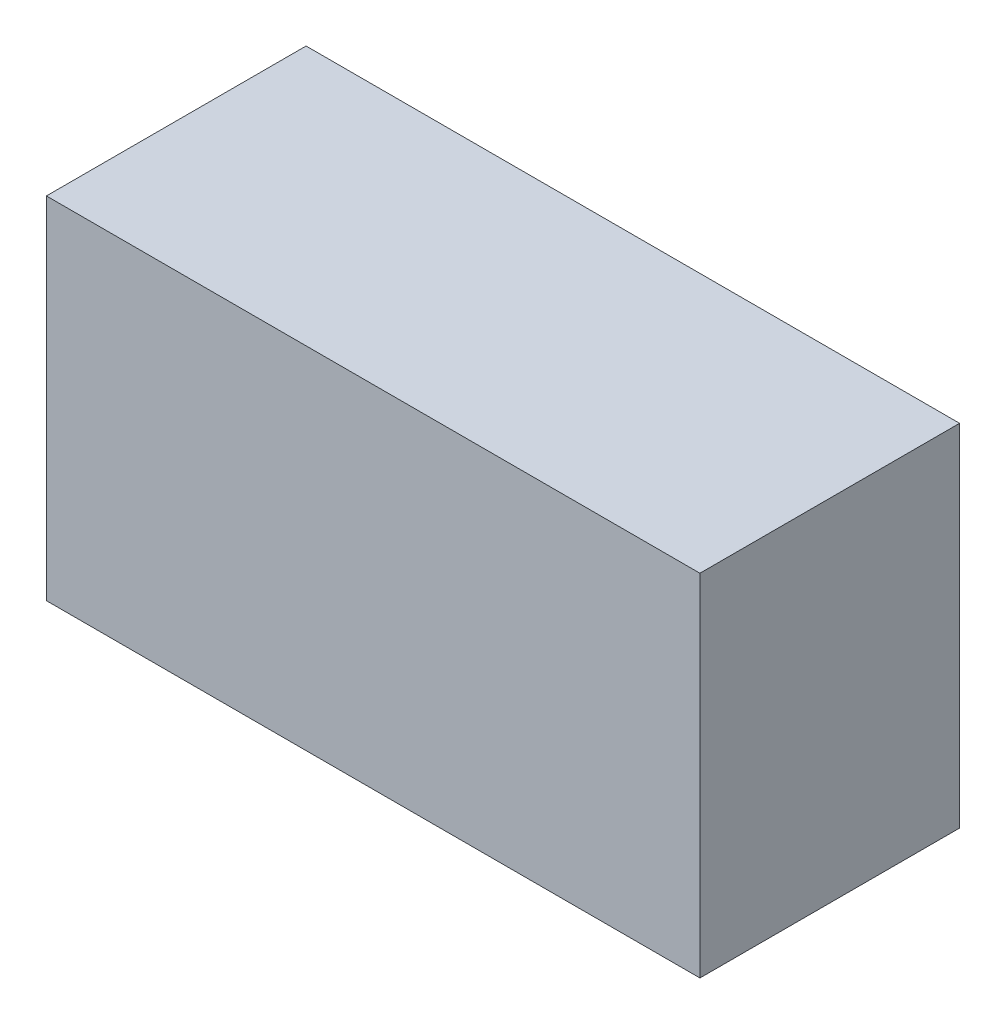
ISO-10303-21;
HEADER;
FILE_DESCRIPTION(('STEP AP214'),'2;1');
FILE_NAME('part.step','',(''),(''),'','','');
FILE_SCHEMA(('AUTOMOTIVE_DESIGN { 1 0 10303 214 1 1 1 1 }'));
ENDSEC;
DATA;
#1=APPLICATION_CONTEXT('core data for automotive mechanical design processes');
#2=APPLICATION_PROTOCOL_DEFINITION('international standard','automotive_design',2000,#1);
#3=PRODUCT_CONTEXT('',#1,'mechanical');
#4=PRODUCT('Part','Part','',(#3));
#5=PRODUCT_RELATED_PRODUCT_CATEGORY('part','',(#4));
#6=PRODUCT_DEFINITION_FORMATION('','',#4);
#7=PRODUCT_DEFINITION_CONTEXT('part definition',#1,'design');
#8=PRODUCT_DEFINITION('design','',#6,#7);
#9=PRODUCT_DEFINITION_SHAPE('','',#8);
#10=(LENGTH_UNIT() NAMED_UNIT(*) SI_UNIT(.MILLI.,.METRE.));
#11=(NAMED_UNIT(*) PLANE_ANGLE_UNIT() SI_UNIT($,.RADIAN.));
#12=(NAMED_UNIT(*) SI_UNIT($,.STERADIAN.) SOLID_ANGLE_UNIT());
#13=UNCERTAINTY_MEASURE_WITH_UNIT(LENGTH_MEASURE(1.E-05),#10,'distance_accuracy_value','');
#14=(GEOMETRIC_REPRESENTATION_CONTEXT(3) GLOBAL_UNCERTAINTY_ASSIGNED_CONTEXT((#13)) GLOBAL_UNIT_ASSIGNED_CONTEXT((#10,
#11,#12)) REPRESENTATION_CONTEXT('',''));
#15=CARTESIAN_POINT('',(0.,0.,0.));
#16=DIRECTION('',(0.,0.,1.));
#17=DIRECTION('',(1.,0.,0.));
#18=AXIS2_PLACEMENT_3D('',#15,#16,#17);
#19=CARTESIAN_POINT('',(-0.75499976,-0.40499792,0.5999988));
#20=DIRECTION('',(0.,0.,1.));
#21=DIRECTION('',(1.,0.,0.));
#22=AXIS2_PLACEMENT_3D('',#19,#20,#21);
#23=PLANE('',#22);
#24=DIRECTION('',(-1.,0.,0.));
#25=VECTOR('',#24,1.);
#26=CARTESIAN_POINT('',(0.75499976,-0.40499792,0.5999988));
#27=LINE('',#26,#25);
#28=CARTESIAN_POINT('',(0.75499976,-0.40499792,0.5999988));
#29=VERTEX_POINT('',#28);
#30=CARTESIAN_POINT('',(-0.75499976,-0.40499792,0.5999988));
#31=VERTEX_POINT('',#30);
#32=EDGE_CURVE('E27',#29,#31,#27,.T.);
#33=ORIENTED_EDGE('',*,*,#32,.F.);
#34=DIRECTION('',(0.,-1.,0.));
#35=VECTOR('',#34,1.);
#36=CARTESIAN_POINT('',(0.75499976,0.40499792,0.5999988));
#37=LINE('',#36,#35);
#38=CARTESIAN_POINT('',(0.75499976,0.40499792,0.5999988));
#39=VERTEX_POINT('',#38);
#40=EDGE_CURVE('E102',#39,#29,#37,.T.);
#41=ORIENTED_EDGE('',*,*,#40,.F.);
#42=DIRECTION('',(1.,0.,0.));
#43=VECTOR('',#42,1.);
#44=CARTESIAN_POINT('',(-0.75499976,0.40499792,0.5999988));
#45=LINE('',#44,#43);
#46=CARTESIAN_POINT('',(-0.75499976,0.40499792,0.5999988));
#47=VERTEX_POINT('',#46);
#48=EDGE_CURVE('E84',#47,#39,#45,.T.);
#49=ORIENTED_EDGE('',*,*,#48,.F.);
#50=DIRECTION('',(0.,1.,0.));
#51=VECTOR('',#50,1.);
#52=CARTESIAN_POINT('',(-0.75499976,-0.40499792,0.5999988));
#53=LINE('',#52,#51);
#54=EDGE_CURVE('E88',#31,#47,#53,.T.);
#55=ORIENTED_EDGE('',*,*,#54,.F.);
#56=EDGE_LOOP('',(#33,#41,#49,#55));
#57=FACE_BOUND('',#56,.T.);
#58=ADVANCED_FACE('F17',(#57),#23,.T.);
#59=CARTESIAN_POINT('',(-0.75499976,-0.40499792,0.));
#60=DIRECTION('',(0.,0.,1.));
#61=DIRECTION('',(1.,0.,0.));
#62=AXIS2_PLACEMENT_3D('',#59,#60,#61);
#63=PLANE('',#62);
#64=DIRECTION('',(0.,1.,0.));
#65=VECTOR('',#64,1.);
#66=CARTESIAN_POINT('',(-0.75499976,-0.40499792,0.));
#67=LINE('',#66,#65);
#68=CARTESIAN_POINT('',(-0.75499976,-0.40499792,0.));
#69=VERTEX_POINT('',#68);
#70=CARTESIAN_POINT('',(-0.75499976,0.40499792,0.));
#71=VERTEX_POINT('',#70);
#72=EDGE_CURVE('E73',#69,#71,#67,.T.);
#73=ORIENTED_EDGE('',*,*,#72,.T.);
#74=DIRECTION('',(1.,0.,0.));
#75=VECTOR('',#74,1.);
#76=CARTESIAN_POINT('',(-0.75499976,0.40499792,0.));
#77=LINE('',#76,#75);
#78=CARTESIAN_POINT('',(0.75499976,0.40499792,0.));
#79=VERTEX_POINT('',#78);
#80=EDGE_CURVE('E100',#71,#79,#77,.T.);
#81=ORIENTED_EDGE('',*,*,#80,.T.);
#82=DIRECTION('',(0.,-1.,0.));
#83=VECTOR('',#82,1.);
#84=CARTESIAN_POINT('',(0.75499976,0.40499792,0.));
#85=LINE('',#84,#83);
#86=CARTESIAN_POINT('',(0.75499976,-0.40499792,0.));
#87=VERTEX_POINT('',#86);
#88=EDGE_CURVE('E21',#79,#87,#85,.T.);
#89=ORIENTED_EDGE('',*,*,#88,.T.);
#90=DIRECTION('',(-1.,0.,0.));
#91=VECTOR('',#90,1.);
#92=CARTESIAN_POINT('',(0.75499976,-0.40499792,0.));
#93=LINE('',#92,#91);
#94=EDGE_CURVE('E11',#87,#69,#93,.T.);
#95=ORIENTED_EDGE('',*,*,#94,.T.);
#96=EDGE_LOOP('',(#73,#81,#89,#95));
#97=FACE_BOUND('',#96,.T.);
#98=ADVANCED_FACE('F19',(#97),#63,.F.);
#99=CARTESIAN_POINT('',(0.75499976,-0.40499792,0.));
#100=DIRECTION('',(0.,-1.,0.));
#101=DIRECTION('',(0.,0.,-1.));
#102=AXIS2_PLACEMENT_3D('',#99,#100,#101);
#103=PLANE('',#102);
#104=DIRECTION('',(0.,0.,1.));
#105=VECTOR('',#104,1.);
#106=CARTESIAN_POINT('',(0.75499976,-0.40499792,0.));
#107=LINE('',#106,#105);
#108=EDGE_CURVE('E111',#87,#29,#107,.T.);
#109=ORIENTED_EDGE('',*,*,#108,.T.);
#110=ORIENTED_EDGE('',*,*,#32,.T.);
#111=DIRECTION('',(0.,0.,1.));
#112=VECTOR('',#111,1.);
#113=CARTESIAN_POINT('',(-0.75499976,-0.40499792,0.));
#114=LINE('',#113,#112);
#115=EDGE_CURVE('E80',#69,#31,#114,.T.);
#116=ORIENTED_EDGE('',*,*,#115,.F.);
#117=ORIENTED_EDGE('',*,*,#94,.F.);
#118=EDGE_LOOP('',(#109,#110,#116,#117));
#119=FACE_BOUND('',#118,.T.);
#120=ADVANCED_FACE('F86',(#119),#103,.T.);
#121=CARTESIAN_POINT('',(0.75499976,0.40499792,0.));
#122=DIRECTION('',(1.,0.,0.));
#123=DIRECTION('',(0.,1.,0.));
#124=AXIS2_PLACEMENT_3D('',#121,#122,#123);
#125=PLANE('',#124);
#126=DIRECTION('',(0.,0.,1.));
#127=VECTOR('',#126,1.);
#128=CARTESIAN_POINT('',(0.75499976,0.40499792,0.));
#129=LINE('',#128,#127);
#130=EDGE_CURVE('E96',#79,#39,#129,.T.);
#131=ORIENTED_EDGE('',*,*,#130,.T.);
#132=ORIENTED_EDGE('',*,*,#40,.T.);
#133=ORIENTED_EDGE('',*,*,#108,.F.);
#134=ORIENTED_EDGE('',*,*,#88,.F.);
#135=EDGE_LOOP('',(#131,#132,#133,#134));
#136=FACE_BOUND('',#135,.T.);
#137=ADVANCED_FACE('F145',(#136),#125,.T.);
#138=CARTESIAN_POINT('',(-0.75499976,0.40499792,0.));
#139=DIRECTION('',(0.,1.,0.));
#140=DIRECTION('',(1.,0.,0.));
#141=AXIS2_PLACEMENT_3D('',#138,#139,#140);
#142=PLANE('',#141);
#143=DIRECTION('',(0.,0.,1.));
#144=VECTOR('',#143,1.);
#145=CARTESIAN_POINT('',(-0.75499976,0.40499792,0.));
#146=LINE('',#145,#144);
#147=EDGE_CURVE('E82',#71,#47,#146,.T.);
#148=ORIENTED_EDGE('',*,*,#147,.T.);
#149=ORIENTED_EDGE('',*,*,#48,.T.);
#150=ORIENTED_EDGE('',*,*,#130,.F.);
#151=ORIENTED_EDGE('',*,*,#80,.F.);
#152=EDGE_LOOP('',(#148,#149,#150,#151));
#153=FACE_BOUND('',#152,.T.);
#154=ADVANCED_FACE('F134',(#153),#142,.T.);
#155=CARTESIAN_POINT('',(-0.75499976,-0.40499792,0.));
#156=DIRECTION('',(-1.,0.,0.));
#157=DIRECTION('',(0.,0.,1.));
#158=AXIS2_PLACEMENT_3D('',#155,#156,#157);
#159=PLANE('',#158);
#160=ORIENTED_EDGE('',*,*,#115,.T.);
#161=ORIENTED_EDGE('',*,*,#54,.T.);
#162=ORIENTED_EDGE('',*,*,#147,.F.);
#163=ORIENTED_EDGE('',*,*,#72,.F.);
#164=EDGE_LOOP('',(#160,#161,#162,#163));
#165=FACE_BOUND('',#164,.T.);
#166=ADVANCED_FACE('F78',(#165),#159,.T.);
#167=CLOSED_SHELL('',(#58,#98,#120,#137,#154,#166));
#168=MANIFOLD_SOLID_BREP('B1',#167);
#169=ADVANCED_BREP_SHAPE_REPRESENTATION('',(#18,#168),#14);
#170=SHAPE_DEFINITION_REPRESENTATION(#9,#169);
ENDSEC;
END-ISO-10303-21;
